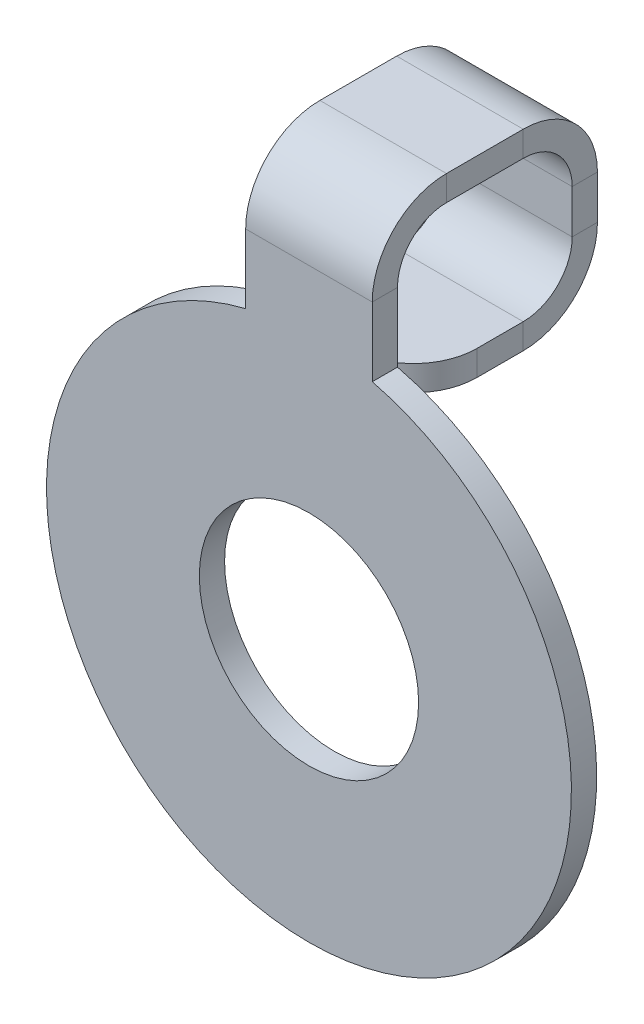
ISO-10303-21;
HEADER;
FILE_DESCRIPTION(('STEP AP214'),'2;1');
FILE_NAME('part.step','',(''),(''),'','','');
FILE_SCHEMA(('AUTOMOTIVE_DESIGN { 1 0 10303 214 1 1 1 1 }'));
ENDSEC;
DATA;
#1=APPLICATION_CONTEXT('core data for automotive mechanical design processes');
#2=APPLICATION_PROTOCOL_DEFINITION('international standard','automotive_design',2000,#1);
#3=PRODUCT_CONTEXT('',#1,'mechanical');
#4=PRODUCT('Part','Part','',(#3));
#5=PRODUCT_RELATED_PRODUCT_CATEGORY('part','',(#4));
#6=PRODUCT_DEFINITION_FORMATION('','',#4);
#7=PRODUCT_DEFINITION_CONTEXT('part definition',#1,'design');
#8=PRODUCT_DEFINITION('design','',#6,#7);
#9=PRODUCT_DEFINITION_SHAPE('','',#8);
#10=(LENGTH_UNIT() NAMED_UNIT(*) SI_UNIT(.MILLI.,.METRE.));
#11=(NAMED_UNIT(*) PLANE_ANGLE_UNIT() SI_UNIT($,.RADIAN.));
#12=(NAMED_UNIT(*) SI_UNIT($,.STERADIAN.) SOLID_ANGLE_UNIT());
#13=UNCERTAINTY_MEASURE_WITH_UNIT(LENGTH_MEASURE(1.E-05),#10,'distance_accuracy_value','');
#14=(GEOMETRIC_REPRESENTATION_CONTEXT(3) GLOBAL_UNCERTAINTY_ASSIGNED_CONTEXT((#13)) GLOBAL_UNIT_ASSIGNED_CONTEXT((#10,
#11,#12)) REPRESENTATION_CONTEXT('',''));
#15=CARTESIAN_POINT('',(0.,0.,0.));
#16=DIRECTION('',(0.,0.,1.));
#17=DIRECTION('',(1.,0.,0.));
#18=AXIS2_PLACEMENT_3D('',#15,#16,#17);
#19=CARTESIAN_POINT('',(0.,10.3311499382041,9.93344981461229));
#20=DIRECTION('',(0.,0.,-1.));
#21=DIRECTION('',(0.,1.,0.));
#22=AXIS2_PLACEMENT_3D('',#19,#20,#21);
#23=PLANE('',#22);
#24=DIRECTION('',(0.,1.,0.));
#25=VECTOR('',#24,1.);
#26=CARTESIAN_POINT('',(0.9525,6.49771234904212,9.93344981461227));
#27=LINE('',#26,#25);
#28=CARTESIAN_POINT('',(0.952500000000001,0.736600000000002,9.93344981461225));
#29=VERTEX_POINT('',#28);
#30=CARTESIAN_POINT('',(0.952500000000001,1.39225006179593,9.93344981461225));
#31=VERTEX_POINT('',#30);
#32=EDGE_CURVE('E56',#29,#31,#27,.T.);
#33=ORIENTED_EDGE('',*,*,#32,.F.);
#34=DIRECTION('',(-1.,0.,0.));
#35=VECTOR('',#34,1.);
#36=CARTESIAN_POINT('',(0.,0.736600000000004,9.93344981461225));
#37=LINE('',#36,#35);
#38=CARTESIAN_POINT('',(-0.952499999999999,0.736600000000004,9.93344981461225));
#39=VERTEX_POINT('',#38);
#40=EDGE_CURVE('E168',#29,#39,#37,.T.);
#41=ORIENTED_EDGE('',*,*,#40,.T.);
#42=DIRECTION('',(0.,-1.,0.));
#43=VECTOR('',#42,1.);
#44=CARTESIAN_POINT('',(-0.9525,6.49771234904212,9.93344981461227));
#45=LINE('',#44,#43);
#46=CARTESIAN_POINT('',(-0.952499999999999,1.39225006179593,9.93344981461225));
#47=VERTEX_POINT('',#46);
#48=EDGE_CURVE('E202',#47,#39,#45,.T.);
#49=ORIENTED_EDGE('',*,*,#48,.F.);
#50=DIRECTION('',(-1.,0.,0.));
#51=VECTOR('',#50,1.);
#52=CARTESIAN_POINT('',(0.,1.39225006179593,9.93344981461225));
#53=LINE('',#52,#51);
#54=EDGE_CURVE('E189',#31,#47,#53,.T.);
#55=ORIENTED_EDGE('',*,*,#54,.F.);
#56=EDGE_LOOP('',(#33,#41,#49,#55));
#57=FACE_BOUND('',#56,.T.);
#58=ADVANCED_FACE('F52',(#57),#23,.T.);
#59=CARTESIAN_POINT('',(0.9525,6.49771234904212,9.93344981461227));
#60=DIRECTION('',(1.,0.,0.));
#61=DIRECTION('',(0.,1.,0.));
#62=AXIS2_PLACEMENT_3D('',#59,#60,#61);
#63=PLANE('',#62);
#64=DIRECTION('',(0.,1.,0.));
#65=VECTOR('',#64,1.);
#66=CARTESIAN_POINT('',(0.9525,6.49771234904212,10.3134498146123));
#67=LINE('',#66,#65);
#68=CARTESIAN_POINT('',(0.952500000000001,0.736600000000002,10.3134498146123));
#69=VERTEX_POINT('',#68);
#70=CARTESIAN_POINT('',(0.952500000000001,1.39225006179593,10.3134498146123));
#71=VERTEX_POINT('',#70);
#72=EDGE_CURVE('E193',#69,#71,#67,.T.);
#73=ORIENTED_EDGE('',*,*,#72,.F.);
#74=DIRECTION('',(0.,0.,-1.));
#75=VECTOR('',#74,1.);
#76=CARTESIAN_POINT('',(0.952500000000001,0.736600000000004,9.93344981461225));
#77=LINE('',#76,#75);
#78=EDGE_CURVE('E175',#69,#29,#77,.T.);
#79=ORIENTED_EDGE('',*,*,#78,.T.);
#80=ORIENTED_EDGE('',*,*,#32,.T.);
#81=DIRECTION('',(0.,0.,-1.));
#82=VECTOR('',#81,1.);
#83=CARTESIAN_POINT('',(0.952500000000001,1.39225006179593,9.93344981461225));
#84=LINE('',#83,#82);
#85=EDGE_CURVE('E194',#71,#31,#84,.T.);
#86=ORIENTED_EDGE('',*,*,#85,.F.);
#87=EDGE_LOOP('',(#73,#79,#80,#86));
#88=FACE_BOUND('',#87,.T.);
#89=ADVANCED_FACE('F196',(#88),#63,.T.);
#90=CARTESIAN_POINT('',(-0.9525,6.49771234904212,9.93344981461227));
#91=DIRECTION('',(-1.,0.,0.));
#92=DIRECTION('',(0.,-1.,0.));
#93=AXIS2_PLACEMENT_3D('',#90,#91,#92);
#94=PLANE('',#93);
#95=ORIENTED_EDGE('',*,*,#48,.T.);
#96=DIRECTION('',(0.,0.,1.));
#97=VECTOR('',#96,1.);
#98=CARTESIAN_POINT('',(-0.952499999999999,0.736600000000004,9.93344981461225));
#99=LINE('',#98,#97);
#100=CARTESIAN_POINT('',(-0.952499999999999,0.736600000000002,10.3134498146123));
#101=VERTEX_POINT('',#100);
#102=EDGE_CURVE('E12',#39,#101,#99,.T.);
#103=ORIENTED_EDGE('',*,*,#102,.T.);
#104=DIRECTION('',(0.,-1.,0.));
#105=VECTOR('',#104,1.);
#106=CARTESIAN_POINT('',(-0.9525,6.49771234904212,10.3134498146123));
#107=LINE('',#106,#105);
#108=CARTESIAN_POINT('',(-0.952499999999999,1.39225006179593,10.3134498146123));
#109=VERTEX_POINT('',#108);
#110=EDGE_CURVE('E205',#109,#101,#107,.T.);
#111=ORIENTED_EDGE('',*,*,#110,.F.);
#112=DIRECTION('',(0.,0.,1.));
#113=VECTOR('',#112,1.);
#114=CARTESIAN_POINT('',(-0.952499999999999,1.39225006179593,9.93344981461225));
#115=LINE('',#114,#113);
#116=EDGE_CURVE('E218',#47,#109,#115,.T.);
#117=ORIENTED_EDGE('',*,*,#116,.F.);
#118=EDGE_LOOP('',(#95,#103,#111,#117));
#119=FACE_BOUND('',#118,.T.);
#120=ADVANCED_FACE('F54',(#119),#94,.T.);
#121=CARTESIAN_POINT('',(0.,2.50885006179587,18.5334498146123));
#122=DIRECTION('',(0.,1.,0.));
#123=DIRECTION('',(0.,0.,1.));
#124=AXIS2_PLACEMENT_3D('',#121,#122,#123);
#125=PLANE('',#124);
#126=DIRECTION('',(0.,0.,1.));
#127=VECTOR('',#126,1.);
#128=CARTESIAN_POINT('',(0.9525,2.5088500617959,14.7000122254503));
#129=LINE('',#128,#127);
#130=CARTESIAN_POINT('',(0.952500000000001,2.50885006179593,11.0500498146123));
#131=VERTEX_POINT('',#130);
#132=CARTESIAN_POINT('',(0.952499999999999,2.50885006179592,12.2056998764082));
#133=VERTEX_POINT('',#132);
#134=EDGE_CURVE('E242',#131,#133,#129,.T.);
#135=ORIENTED_EDGE('',*,*,#134,.F.);
#136=DIRECTION('',(-1.,0.,0.));
#137=VECTOR('',#136,1.);
#138=CARTESIAN_POINT('',(0.,2.50885006179593,11.0500498146123));
#139=LINE('',#138,#137);
#140=CARTESIAN_POINT('',(-0.9525,2.50885006179593,11.0500498146123));
#141=VERTEX_POINT('',#140);
#142=EDGE_CURVE('E281',#131,#141,#139,.T.);
#143=ORIENTED_EDGE('',*,*,#142,.T.);
#144=DIRECTION('',(0.,0.,-1.));
#145=VECTOR('',#144,1.);
#146=CARTESIAN_POINT('',(-0.9525,2.5088500617959,14.7000122254503));
#147=LINE('',#146,#145);
#148=CARTESIAN_POINT('',(-0.9525,2.50885006179592,12.2056998764082));
#149=VERTEX_POINT('',#148);
#150=EDGE_CURVE('E236',#149,#141,#147,.T.);
#151=ORIENTED_EDGE('',*,*,#150,.F.);
#152=DIRECTION('',(1.,0.,0.));
#153=VECTOR('',#152,1.);
#154=CARTESIAN_POINT('',(0.,2.50885006179592,12.2056998764082));
#155=LINE('',#154,#153);
#156=EDGE_CURVE('E243',#149,#133,#155,.T.);
#157=ORIENTED_EDGE('',*,*,#156,.T.);
#158=EDGE_LOOP('',(#135,#143,#151,#157));
#159=FACE_BOUND('',#158,.T.);
#160=ADVANCED_FACE('F314',(#159),#125,.T.);
#161=CARTESIAN_POINT('',(0.9525,2.5088500617959,14.7000122254503));
#162=DIRECTION('',(1.,0.,0.));
#163=DIRECTION('',(0.,0.,1.));
#164=AXIS2_PLACEMENT_3D('',#161,#162,#163);
#165=PLANE('',#164);
#166=DIRECTION('',(0.,0.,1.));
#167=VECTOR('',#166,1.);
#168=CARTESIAN_POINT('',(0.9525,2.1288500617959,14.7000122254503));
#169=LINE('',#168,#167);
#170=CARTESIAN_POINT('',(0.952500000000001,2.12885006179593,11.0500498146123));
#171=VERTEX_POINT('',#170);
#172=CARTESIAN_POINT('',(0.9525,2.12885006179592,12.2056998764082));
#173=VERTEX_POINT('',#172);
#174=EDGE_CURVE('E237',#171,#173,#169,.T.);
#175=ORIENTED_EDGE('',*,*,#174,.F.);
#176=DIRECTION('',(0.,1.,0.));
#177=VECTOR('',#176,1.);
#178=CARTESIAN_POINT('',(0.952500000000001,2.50885006179593,11.0500498146123));
#179=LINE('',#178,#177);
#180=EDGE_CURVE('E289',#171,#131,#179,.T.);
#181=ORIENTED_EDGE('',*,*,#180,.T.);
#182=ORIENTED_EDGE('',*,*,#134,.T.);
#183=DIRECTION('',(0.,-1.,0.));
#184=VECTOR('',#183,1.);
#185=CARTESIAN_POINT('',(0.9525,2.50885006179592,12.2056998764082));
#186=LINE('',#185,#184);
#187=EDGE_CURVE('E238',#133,#173,#186,.T.);
#188=ORIENTED_EDGE('',*,*,#187,.T.);
#189=EDGE_LOOP('',(#175,#181,#182,#188));
#190=FACE_BOUND('',#189,.T.);
#191=ADVANCED_FACE('F304',(#190),#165,.T.);
#192=CARTESIAN_POINT('',(-0.9525,2.5088500617959,14.7000122254503));
#193=DIRECTION('',(-1.,0.,0.));
#194=DIRECTION('',(0.,0.,-1.));
#195=AXIS2_PLACEMENT_3D('',#192,#193,#194);
#196=PLANE('',#195);
#197=ORIENTED_EDGE('',*,*,#150,.T.);
#198=DIRECTION('',(0.,-1.,0.));
#199=VECTOR('',#198,1.);
#200=CARTESIAN_POINT('',(-0.9525,2.50885006179593,11.0500498146123));
#201=LINE('',#200,#199);
#202=CARTESIAN_POINT('',(-0.952499999999999,2.12885006179593,11.0500498146123));
#203=VERTEX_POINT('',#202);
#204=EDGE_CURVE('E176',#141,#203,#201,.T.);
#205=ORIENTED_EDGE('',*,*,#204,.T.);
#206=DIRECTION('',(0.,0.,-1.));
#207=VECTOR('',#206,1.);
#208=CARTESIAN_POINT('',(-0.9525,2.1288500617959,14.7000122254503));
#209=LINE('',#208,#207);
#210=CARTESIAN_POINT('',(-0.9525,2.12885006179592,12.2056998764082));
#211=VERTEX_POINT('',#210);
#212=EDGE_CURVE('E241',#211,#203,#209,.T.);
#213=ORIENTED_EDGE('',*,*,#212,.F.);
#214=DIRECTION('',(0.,1.,0.));
#215=VECTOR('',#214,1.);
#216=CARTESIAN_POINT('',(-0.9525,2.50885006179592,12.2056998764082));
#217=LINE('',#216,#215);
#218=EDGE_CURVE('E233',#211,#149,#217,.T.);
#219=ORIENTED_EDGE('',*,*,#218,.T.);
#220=EDGE_LOOP('',(#197,#205,#213,#219));
#221=FACE_BOUND('',#220,.T.);
#222=ADVANCED_FACE('F317',(#221),#196,.T.);
#223=CARTESIAN_POINT('',(0.,-3.48000000000001,12.9422998764081));
#224=DIRECTION('',(0.,0.,1.));
#225=DIRECTION('',(0.,-1.,0.));
#226=AXIS2_PLACEMENT_3D('',#223,#224,#225);
#227=PLANE('',#226);
#228=CARTESIAN_POINT('',(0.,-3.48000000000001,12.9422998764081));
#229=DIRECTION('',(0.,0.,-1.));
#230=DIRECTION('',(0.,1.,0.));
#231=AXIS2_PLACEMENT_3D('',#228,#229,#230);
#232=CIRCLE('',#231,1.65);
#233=CARTESIAN_POINT('',(0.,-1.83000000000001,12.9422998764082));
#234=VERTEX_POINT('',#233);
#235=EDGE_CURVE('E252',#234,#234,#232,.T.);
#236=ORIENTED_EDGE('',*,*,#235,.F.);
#237=EDGE_LOOP('',(#236));
#238=FACE_BOUND('',#237,.T.);
#239=DIRECTION('',(0.,1.,0.));
#240=VECTOR('',#239,1.);
#241=CARTESIAN_POINT('',(-0.9525,0.353437589161967,12.9422998764082));
#242=LINE('',#241,#240);
#243=CARTESIAN_POINT('',(-0.9525,0.353437589161967,12.9422998764082));
#244=VERTEX_POINT('',#243);
#245=CARTESIAN_POINT('',(-0.9525,1.39225006179591,12.9422998764082));
#246=VERTEX_POINT('',#245);
#247=EDGE_CURVE('E262',#244,#246,#242,.T.);
#248=ORIENTED_EDGE('',*,*,#247,.T.);
#249=DIRECTION('',(1.,0.,0.));
#250=VECTOR('',#249,1.);
#251=CARTESIAN_POINT('',(0.,1.39225006179591,12.9422998764082));
#252=LINE('',#251,#250);
#253=CARTESIAN_POINT('',(0.9525,1.39225006179591,12.9422998764082));
#254=VERTEX_POINT('',#253);
#255=EDGE_CURVE('E275',#246,#254,#252,.T.);
#256=ORIENTED_EDGE('',*,*,#255,.T.);
#257=DIRECTION('',(0.,-1.,0.));
#258=VECTOR('',#257,1.);
#259=CARTESIAN_POINT('',(0.9525,0.353437589161967,12.9422998764082));
#260=LINE('',#259,#258);
#261=CARTESIAN_POINT('',(0.9525,0.353437589161967,12.9422998764082));
#262=VERTEX_POINT('',#261);
#263=EDGE_CURVE('E259',#254,#262,#260,.T.);
#264=ORIENTED_EDGE('',*,*,#263,.T.);
#265=CARTESIAN_POINT('',(0.,-3.48000000000001,12.9422998764081));
#266=DIRECTION('',(0.,0.,-1.));
#267=DIRECTION('',(0.,-1.,0.));
#268=AXIS2_PLACEMENT_3D('',#265,#266,#267);
#269=CIRCLE('',#268,3.95);
#270=EDGE_CURVE('E251',#262,#244,#269,.T.);
#271=ORIENTED_EDGE('',*,*,#270,.T.);
#272=EDGE_LOOP('',(#248,#256,#264,#271));
#273=FACE_BOUND('',#272,.T.);
#274=ADVANCED_FACE('F326',(#238,#273),#227,.F.);
#275=CARTESIAN_POINT('',(0.,-3.48000000000002,13.3222998764081));
#276=DIRECTION('',(0.,0.,-1.));
#277=DIRECTION('',(0.,1.,0.));
#278=AXIS2_PLACEMENT_3D('',#275,#276,#277);
#279=CYLINDRICAL_SURFACE('',#278,3.95);
#280=ORIENTED_EDGE('',*,*,#270,.F.);
#281=DIRECTION('',(0.,0.,-1.));
#282=VECTOR('',#281,1.);
#283=CARTESIAN_POINT('',(0.9525,0.353437589161964,13.3222998764082));
#284=LINE('',#283,#282);
#285=CARTESIAN_POINT('',(0.9525,0.353437589161964,13.3222998764082));
#286=VERTEX_POINT('',#285);
#287=EDGE_CURVE('E263',#286,#262,#284,.T.);
#288=ORIENTED_EDGE('',*,*,#287,.F.);
#289=CARTESIAN_POINT('',(0.,-3.48000000000002,13.3222998764081));
#290=DIRECTION('',(0.,0.,-1.));
#291=DIRECTION('',(0.,-1.,0.));
#292=AXIS2_PLACEMENT_3D('',#289,#290,#291);
#293=CIRCLE('',#292,3.95);
#294=CARTESIAN_POINT('',(-0.9525,0.353437589161964,13.3222998764082));
#295=VERTEX_POINT('',#294);
#296=EDGE_CURVE('E255',#286,#295,#293,.T.);
#297=ORIENTED_EDGE('',*,*,#296,.T.);
#298=DIRECTION('',(0.,0.,-1.));
#299=VECTOR('',#298,1.);
#300=CARTESIAN_POINT('',(-0.9525,0.353437589161964,13.3222998764082));
#301=LINE('',#300,#299);
#302=EDGE_CURVE('E267',#295,#244,#301,.T.);
#303=ORIENTED_EDGE('',*,*,#302,.T.);
#304=EDGE_LOOP('',(#280,#288,#297,#303));
#305=FACE_BOUND('',#304,.T.);
#306=ADVANCED_FACE('F340',(#305),#279,.T.);
#307=CARTESIAN_POINT('',(0.9525,0.353437589161964,13.3222998764082));
#308=DIRECTION('',(1.,0.,0.));
#309=DIRECTION('',(0.,-1.,0.));
#310=AXIS2_PLACEMENT_3D('',#307,#308,#309);
#311=PLANE('',#310);
#312=DIRECTION('',(0.,0.,-1.));
#313=VECTOR('',#312,1.);
#314=CARTESIAN_POINT('',(0.9525,1.39225006179591,13.3222998764082));
#315=LINE('',#314,#313);
#316=CARTESIAN_POINT('',(0.9525,1.39225006179591,13.3222998764082));
#317=VERTEX_POINT('',#316);
#318=EDGE_CURVE('E272',#317,#254,#315,.T.);
#319=ORIENTED_EDGE('',*,*,#318,.F.);
#320=DIRECTION('',(0.,-1.,0.));
#321=VECTOR('',#320,1.);
#322=CARTESIAN_POINT('',(0.9525,0.353437589161964,13.3222998764082));
#323=LINE('',#322,#321);
#324=EDGE_CURVE('E269',#317,#286,#323,.T.);
#325=ORIENTED_EDGE('',*,*,#324,.T.);
#326=ORIENTED_EDGE('',*,*,#287,.T.);
#327=ORIENTED_EDGE('',*,*,#263,.F.);
#328=EDGE_LOOP('',(#319,#325,#326,#327));
#329=FACE_BOUND('',#328,.T.);
#330=ADVANCED_FACE('F331',(#329),#311,.T.);
#331=CARTESIAN_POINT('',(-0.9525,0.353437589161964,13.3222998764082));
#332=DIRECTION('',(-1.,0.,0.));
#333=DIRECTION('',(0.,1.,0.));
#334=AXIS2_PLACEMENT_3D('',#331,#332,#333);
#335=PLANE('',#334);
#336=DIRECTION('',(0.,0.,1.));
#337=VECTOR('',#336,1.);
#338=CARTESIAN_POINT('',(-0.9525,1.39225006179591,13.3222998764082));
#339=LINE('',#338,#337);
#340=CARTESIAN_POINT('',(-0.9525,1.39225006179591,13.3222998764082));
#341=VERTEX_POINT('',#340);
#342=EDGE_CURVE('E278',#246,#341,#339,.T.);
#343=ORIENTED_EDGE('',*,*,#342,.F.);
#344=ORIENTED_EDGE('',*,*,#247,.F.);
#345=ORIENTED_EDGE('',*,*,#302,.F.);
#346=DIRECTION('',(0.,1.,0.));
#347=VECTOR('',#346,1.);
#348=CARTESIAN_POINT('',(-0.9525,0.353437589161964,13.3222998764082));
#349=LINE('',#348,#347);
#350=EDGE_CURVE('E258',#295,#341,#349,.T.);
#351=ORIENTED_EDGE('',*,*,#350,.T.);
#352=EDGE_LOOP('',(#343,#344,#345,#351));
#353=FACE_BOUND('',#352,.T.);
#354=ADVANCED_FACE('F342',(#353),#335,.T.);
#355=CARTESIAN_POINT('',(0.,-3.48000000000002,13.3222998764081));
#356=DIRECTION('',(0.,0.,1.));
#357=DIRECTION('',(0.,-1.,0.));
#358=AXIS2_PLACEMENT_3D('',#355,#356,#357);
#359=PLANE('',#358);
#360=DIRECTION('',(1.,0.,0.));
#361=VECTOR('',#360,1.);
#362=CARTESIAN_POINT('',(0.,1.39225006179591,13.3222998764082));
#363=LINE('',#362,#361);
#364=EDGE_CURVE('E266',#341,#317,#363,.T.);
#365=ORIENTED_EDGE('',*,*,#364,.F.);
#366=ORIENTED_EDGE('',*,*,#350,.F.);
#367=ORIENTED_EDGE('',*,*,#296,.F.);
#368=ORIENTED_EDGE('',*,*,#324,.F.);
#369=EDGE_LOOP('',(#365,#366,#367,#368));
#370=FACE_BOUND('',#369,.T.);
#371=CARTESIAN_POINT('',(0.,-3.48000000000002,13.3222998764081));
#372=DIRECTION('',(0.,0.,-1.));
#373=DIRECTION('',(0.,1.,0.));
#374=AXIS2_PLACEMENT_3D('',#371,#372,#373);
#375=CIRCLE('',#374,1.65);
#376=CARTESIAN_POINT('',(0.,-1.83000000000002,13.3222998764082));
#377=VERTEX_POINT('',#376);
#378=EDGE_CURVE('E248',#377,#377,#375,.T.);
#379=ORIENTED_EDGE('',*,*,#378,.T.);
#380=EDGE_LOOP('',(#379));
#381=FACE_BOUND('',#380,.T.);
#382=ADVANCED_FACE('F335',(#370,#381),#359,.T.);
#383=CARTESIAN_POINT('',(0.,-3.48000000000002,13.3222998764081));
#384=DIRECTION('',(0.,0.,-1.));
#385=DIRECTION('',(0.,1.,0.));
#386=AXIS2_PLACEMENT_3D('',#383,#384,#385);
#387=CYLINDRICAL_SURFACE('',#386,1.65);
#388=ORIENTED_EDGE('',*,*,#378,.F.);
#389=EDGE_LOOP('',(#388));
#390=FACE_BOUND('',#389,.T.);
#391=ORIENTED_EDGE('',*,*,#235,.T.);
#392=EDGE_LOOP('',(#391));
#393=FACE_BOUND('',#392,.T.);
#394=ADVANCED_FACE('F349',(#390,#393),#387,.F.);
#395=CARTESIAN_POINT('',(0.,2.12885006179587,18.5334498146123));
#396=DIRECTION('',(0.,1.,0.));
#397=DIRECTION('',(0.,0.,1.));
#398=AXIS2_PLACEMENT_3D('',#395,#396,#397);
#399=PLANE('',#398);
#400=DIRECTION('',(-1.,0.,0.));
#401=VECTOR('',#400,1.);
#402=CARTESIAN_POINT('',(0.,2.12885006179593,11.0500498146123));
#403=LINE('',#402,#401);
#404=EDGE_CURVE('E292',#171,#203,#403,.T.);
#405=ORIENTED_EDGE('',*,*,#404,.F.);
#406=ORIENTED_EDGE('',*,*,#174,.T.);
#407=DIRECTION('',(1.,0.,0.));
#408=VECTOR('',#407,1.);
#409=CARTESIAN_POINT('',(0.,2.12885006179592,12.2056998764082));
#410=LINE('',#409,#408);
#411=EDGE_CURVE('E228',#211,#173,#410,.T.);
#412=ORIENTED_EDGE('',*,*,#411,.F.);
#413=ORIENTED_EDGE('',*,*,#212,.T.);
#414=EDGE_LOOP('',(#405,#406,#412,#413));
#415=FACE_BOUND('',#414,.T.);
#416=ADVANCED_FACE('F427',(#415),#399,.F.);
#417=CARTESIAN_POINT('',(-0.9525,1.39225006179592,12.2056998764082));
#418=DIRECTION('',(-1.,0.,0.));
#419=DIRECTION('',(0.,0.,-1.));
#420=AXIS2_PLACEMENT_3D('',#417,#418,#419);
#421=PLANE('',#420);
#422=ORIENTED_EDGE('',*,*,#218,.F.);
#423=CARTESIAN_POINT('',(-0.9525,1.39225006179592,12.2056998764082));
#424=DIRECTION('',(1.,0.,0.));
#425=DIRECTION('',(0.,0.,1.));
#426=AXIS2_PLACEMENT_3D('',#423,#424,#425);
#427=CIRCLE('',#426,0.7366);
#428=EDGE_CURVE('E204',#211,#246,#427,.T.);
#429=ORIENTED_EDGE('',*,*,#428,.T.);
#430=ORIENTED_EDGE('',*,*,#342,.T.);
#431=CARTESIAN_POINT('',(-0.9525,1.39225006179592,12.2056998764082));
#432=DIRECTION('',(1.,0.,0.));
#433=DIRECTION('',(0.,0.,-1.));
#434=AXIS2_PLACEMENT_3D('',#431,#432,#433);
#435=CIRCLE('',#434,1.1166);
#436=EDGE_CURVE('E221',#149,#341,#435,.T.);
#437=ORIENTED_EDGE('',*,*,#436,.F.);
#438=EDGE_LOOP('',(#422,#429,#430,#437));
#439=FACE_BOUND('',#438,.T.);
#440=ADVANCED_FACE('F321',(#439),#421,.T.);
#441=CARTESIAN_POINT('',(0.9525,1.39225006179592,12.2056998764082));
#442=DIRECTION('',(1.,0.,0.));
#443=DIRECTION('',(0.,0.,1.));
#444=AXIS2_PLACEMENT_3D('',#441,#442,#443);
#445=PLANE('',#444);
#446=CARTESIAN_POINT('',(0.9525,1.39225006179592,12.2056998764082));
#447=DIRECTION('',(1.,0.,0.));
#448=DIRECTION('',(0.,0.,1.));
#449=AXIS2_PLACEMENT_3D('',#446,#447,#448);
#450=CIRCLE('',#449,0.7366);
#451=EDGE_CURVE('E225',#254,#173,#450,.F.);
#452=ORIENTED_EDGE('',*,*,#451,.T.);
#453=ORIENTED_EDGE('',*,*,#187,.F.);
#454=CARTESIAN_POINT('',(0.9525,1.39225006179592,12.2056998764082));
#455=DIRECTION('',(-1.,0.,0.));
#456=DIRECTION('',(0.,0.,1.));
#457=AXIS2_PLACEMENT_3D('',#454,#455,#456);
#458=CIRCLE('',#457,1.1166);
#459=EDGE_CURVE('E224',#317,#133,#458,.T.);
#460=ORIENTED_EDGE('',*,*,#459,.F.);
#461=ORIENTED_EDGE('',*,*,#318,.T.);
#462=EDGE_LOOP('',(#452,#453,#460,#461));
#463=FACE_BOUND('',#462,.T.);
#464=ADVANCED_FACE('F308',(#463),#445,.T.);
#465=CARTESIAN_POINT('',(-2.42732463634845,1.39225006179592,12.2056998764082));
#466=DIRECTION('',(1.,0.,0.));
#467=DIRECTION('',(0.,0.,1.));
#468=AXIS2_PLACEMENT_3D('',#465,#466,#467);
#469=CYLINDRICAL_SURFACE('',#468,1.1166);
#470=ORIENTED_EDGE('',*,*,#364,.T.);
#471=ORIENTED_EDGE('',*,*,#459,.T.);
#472=ORIENTED_EDGE('',*,*,#156,.F.);
#473=ORIENTED_EDGE('',*,*,#436,.T.);
#474=EDGE_LOOP('',(#470,#471,#472,#473));
#475=FACE_BOUND('',#474,.T.);
#476=ADVANCED_FACE('F311',(#475),#469,.T.);
#477=CARTESIAN_POINT('',(-2.42732463634845,1.39225006179592,12.2056998764082));
#478=DIRECTION('',(1.,0.,0.));
#479=DIRECTION('',(0.,0.,1.));
#480=AXIS2_PLACEMENT_3D('',#477,#478,#479);
#481=CYLINDRICAL_SURFACE('',#480,0.7366);
#482=ORIENTED_EDGE('',*,*,#255,.F.);
#483=ORIENTED_EDGE('',*,*,#428,.F.);
#484=ORIENTED_EDGE('',*,*,#411,.T.);
#485=ORIENTED_EDGE('',*,*,#451,.F.);
#486=EDGE_LOOP('',(#482,#483,#484,#485));
#487=FACE_BOUND('',#486,.T.);
#488=ADVANCED_FACE('F324',(#487),#481,.F.);
#489=CARTESIAN_POINT('',(0.,10.3311499382041,10.3134498146123));
#490=DIRECTION('',(0.,0.,-1.));
#491=DIRECTION('',(0.,1.,0.));
#492=AXIS2_PLACEMENT_3D('',#489,#490,#491);
#493=PLANE('',#492);
#494=DIRECTION('',(-1.,0.,0.));
#495=VECTOR('',#494,1.);
#496=CARTESIAN_POINT('',(0.,0.736600000000002,10.3134498146123));
#497=LINE('',#496,#495);
#498=EDGE_CURVE('E61',#69,#101,#497,.T.);
#499=ORIENTED_EDGE('',*,*,#498,.F.);
#500=ORIENTED_EDGE('',*,*,#72,.T.);
#501=DIRECTION('',(-1.,0.,0.));
#502=VECTOR('',#501,1.);
#503=CARTESIAN_POINT('',(0.,1.39225006179593,10.3134498146123));
#504=LINE('',#503,#502);
#505=EDGE_CURVE('E207',#71,#109,#504,.T.);
#506=ORIENTED_EDGE('',*,*,#505,.T.);
#507=ORIENTED_EDGE('',*,*,#110,.T.);
#508=EDGE_LOOP('',(#499,#500,#506,#507));
#509=FACE_BOUND('',#508,.T.);
#510=ADVANCED_FACE('F362',(#509),#493,.F.);
#511=CARTESIAN_POINT('',(0.952500000000001,1.39225006179593,11.0500498146123));
#512=DIRECTION('',(1.,0.,0.));
#513=DIRECTION('',(0.,1.,0.));
#514=AXIS2_PLACEMENT_3D('',#511,#512,#513);
#515=PLANE('',#514);
#516=ORIENTED_EDGE('',*,*,#180,.F.);
#517=CARTESIAN_POINT('',(0.952500000000001,1.39225006179593,11.0500498146123));
#518=DIRECTION('',(1.,0.,0.));
#519=DIRECTION('',(0.,1.,0.));
#520=AXIS2_PLACEMENT_3D('',#517,#518,#519);
#521=CIRCLE('',#520,0.7366);
#522=EDGE_CURVE('E391',#171,#71,#521,.F.);
#523=ORIENTED_EDGE('',*,*,#522,.T.);
#524=ORIENTED_EDGE('',*,*,#85,.T.);
#525=CARTESIAN_POINT('',(0.952500000000001,1.39225006179593,11.0500498146123));
#526=DIRECTION('',(-1.,0.,0.));
#527=DIRECTION('',(0.,1.,0.));
#528=AXIS2_PLACEMENT_3D('',#525,#526,#527);
#529=CIRCLE('',#528,1.1166);
#530=EDGE_CURVE('E415',#131,#31,#529,.T.);
#531=ORIENTED_EDGE('',*,*,#530,.F.);
#532=EDGE_LOOP('',(#516,#523,#524,#531));
#533=FACE_BOUND('',#532,.T.);
#534=ADVANCED_FACE('F364',(#533),#515,.T.);
#535=CARTESIAN_POINT('',(-0.9525,1.39225006179593,11.0500498146123));
#536=DIRECTION('',(-1.,0.,0.));
#537=DIRECTION('',(0.,-1.,0.));
#538=AXIS2_PLACEMENT_3D('',#535,#536,#537);
#539=PLANE('',#538);
#540=CARTESIAN_POINT('',(-0.952499999999999,1.39225006179593,11.0500498146123));
#541=DIRECTION('',(1.,0.,0.));
#542=DIRECTION('',(0.,1.,0.));
#543=AXIS2_PLACEMENT_3D('',#540,#541,#542);
#544=CIRCLE('',#543,0.7366);
#545=EDGE_CURVE('E215',#109,#203,#544,.T.);
#546=ORIENTED_EDGE('',*,*,#545,.T.);
#547=ORIENTED_EDGE('',*,*,#204,.F.);
#548=CARTESIAN_POINT('',(-0.9525,1.39225006179593,11.0500498146123));
#549=DIRECTION('',(1.,0.,0.));
#550=DIRECTION('',(0.,-1.,0.));
#551=AXIS2_PLACEMENT_3D('',#548,#549,#550);
#552=CIRCLE('',#551,1.1166);
#553=EDGE_CURVE('E77',#47,#141,#552,.T.);
#554=ORIENTED_EDGE('',*,*,#553,.F.);
#555=ORIENTED_EDGE('',*,*,#116,.T.);
#556=EDGE_LOOP('',(#546,#547,#554,#555));
#557=FACE_BOUND('',#556,.T.);
#558=ADVANCED_FACE('F369',(#557),#539,.T.);
#559=CARTESIAN_POINT('',(-2.42732463634845,1.39225006179593,11.0500498146123));
#560=DIRECTION('',(1.,0.,0.));
#561=DIRECTION('',(0.,1.,0.));
#562=AXIS2_PLACEMENT_3D('',#559,#560,#561);
#563=CYLINDRICAL_SURFACE('',#562,1.1166);
#564=ORIENTED_EDGE('',*,*,#54,.T.);
#565=ORIENTED_EDGE('',*,*,#553,.T.);
#566=ORIENTED_EDGE('',*,*,#142,.F.);
#567=ORIENTED_EDGE('',*,*,#530,.T.);
#568=EDGE_LOOP('',(#564,#565,#566,#567));
#569=FACE_BOUND('',#568,.T.);
#570=ADVANCED_FACE('F431',(#569),#563,.T.);
#571=CARTESIAN_POINT('',(-2.42732463634845,1.39225006179593,11.0500498146123));
#572=DIRECTION('',(1.,0.,0.));
#573=DIRECTION('',(0.,1.,0.));
#574=AXIS2_PLACEMENT_3D('',#571,#572,#573);
#575=CYLINDRICAL_SURFACE('',#574,0.7366);
#576=ORIENTED_EDGE('',*,*,#505,.F.);
#577=ORIENTED_EDGE('',*,*,#522,.F.);
#578=ORIENTED_EDGE('',*,*,#404,.T.);
#579=ORIENTED_EDGE('',*,*,#545,.F.);
#580=EDGE_LOOP('',(#576,#577,#578,#579));
#581=FACE_BOUND('',#580,.T.);
#582=ADVANCED_FACE('F428',(#581),#575,.F.);
#583=CARTESIAN_POINT('',(0.,-0.38,11.7475));
#584=DIRECTION('',(0.,1.,0.));
#585=DIRECTION('',(0.,0.,1.));
#586=AXIS2_PLACEMENT_3D('',#583,#584,#585);
#587=CYLINDRICAL_SURFACE('',#586,0.9525);
#588=CARTESIAN_POINT('',(0.,0.,11.7475));
#589=DIRECTION('',(0.,1.,0.));
#590=DIRECTION('',(0.,0.,-1.));
#591=AXIS2_PLACEMENT_3D('',#588,#589,#590);
#592=CIRCLE('',#591,0.9525);
#593=CARTESIAN_POINT('',(-0.952499999999999,0.,11.7475));
#594=VERTEX_POINT('',#593);
#595=CARTESIAN_POINT('',(0.952500000000001,0.,11.7475));
#596=VERTEX_POINT('',#595);
#597=EDGE_CURVE('E394',#594,#596,#592,.T.);
#598=ORIENTED_EDGE('',*,*,#597,.F.);
#599=DIRECTION('',(0.,1.,0.));
#600=VECTOR('',#599,1.);
#601=CARTESIAN_POINT('',(-0.952499999999999,-0.38,11.7475));
#602=LINE('',#601,#600);
#603=CARTESIAN_POINT('',(-0.952499999999999,-0.38,11.7475));
#604=VERTEX_POINT('',#603);
#605=EDGE_CURVE('E388',#604,#594,#602,.T.);
#606=ORIENTED_EDGE('',*,*,#605,.F.);
#607=CARTESIAN_POINT('',(0.,-0.38,11.7475));
#608=DIRECTION('',(0.,1.,0.));
#609=DIRECTION('',(0.,0.,-1.));
#610=AXIS2_PLACEMENT_3D('',#607,#608,#609);
#611=CIRCLE('',#610,0.9525);
#612=CARTESIAN_POINT('',(0.952500000000001,-0.38,11.7475));
#613=VERTEX_POINT('',#612);
#614=EDGE_CURVE('E408',#604,#613,#611,.T.);
#615=ORIENTED_EDGE('',*,*,#614,.T.);
#616=DIRECTION('',(0.,1.,0.));
#617=VECTOR('',#616,1.);
#618=CARTESIAN_POINT('',(0.952500000000001,-0.38,11.7475));
#619=LINE('',#618,#617);
#620=EDGE_CURVE('E406',#613,#596,#619,.T.);
#621=ORIENTED_EDGE('',*,*,#620,.T.);
#622=EDGE_LOOP('',(#598,#606,#615,#621));
#623=FACE_BOUND('',#622,.T.);
#624=ADVANCED_FACE('F430',(#623),#587,.T.);
#625=CARTESIAN_POINT('',(0.,-0.38,0.));
#626=DIRECTION('',(0.,-1.,0.));
#627=DIRECTION('',(0.,0.,-1.));
#628=AXIS2_PLACEMENT_3D('',#625,#626,#627);
#629=PLANE('',#628);
#630=DIRECTION('',(-1.,0.,0.));
#631=VECTOR('',#630,1.);
#632=CARTESIAN_POINT('',(0.,-0.38,11.0500498146123));
#633=LINE('',#632,#631);
#634=CARTESIAN_POINT('',(0.952500000000001,-0.38,11.0500498146123));
#635=VERTEX_POINT('',#634);
#636=CARTESIAN_POINT('',(-0.952499999999999,-0.38,11.0500498146123));
#637=VERTEX_POINT('',#636);
#638=EDGE_CURVE('E413',#635,#637,#633,.T.);
#639=ORIENTED_EDGE('',*,*,#638,.F.);
#640=DIRECTION('',(0.,0.,-1.));
#641=VECTOR('',#640,1.);
#642=CARTESIAN_POINT('',(0.9525,-0.38,3.83343758916198));
#643=LINE('',#642,#641);
#644=EDGE_CURVE('E404',#613,#635,#643,.T.);
#645=ORIENTED_EDGE('',*,*,#644,.F.);
#646=ORIENTED_EDGE('',*,*,#614,.F.);
#647=DIRECTION('',(0.,0.,1.));
#648=VECTOR('',#647,1.);
#649=CARTESIAN_POINT('',(-0.9525,-0.38,3.83343758916198));
#650=LINE('',#649,#648);
#651=EDGE_CURVE('E392',#637,#604,#650,.T.);
#652=ORIENTED_EDGE('',*,*,#651,.F.);
#653=EDGE_LOOP('',(#639,#645,#646,#652));
#654=FACE_BOUND('',#653,.T.);
#655=ADVANCED_FACE('F437',(#654),#629,.T.);
#656=CARTESIAN_POINT('',(0.9525,-0.38,3.83343758916198));
#657=DIRECTION('',(1.,0.,0.));
#658=DIRECTION('',(0.,0.,-1.));
#659=AXIS2_PLACEMENT_3D('',#656,#657,#658);
#660=PLANE('',#659);
#661=DIRECTION('',(0.,-1.,0.));
#662=VECTOR('',#661,1.);
#663=CARTESIAN_POINT('',(0.952500000000001,-0.38,11.0500498146123));
#664=LINE('',#663,#662);
#665=CARTESIAN_POINT('',(0.952500000000001,0.,11.0500498146123));
#666=VERTEX_POINT('',#665);
#667=EDGE_CURVE('E185',#666,#635,#664,.T.);
#668=ORIENTED_EDGE('',*,*,#667,.F.);
#669=DIRECTION('',(0.,0.,-1.));
#670=VECTOR('',#669,1.);
#671=CARTESIAN_POINT('',(0.9525,0.,3.83343758916198));
#672=LINE('',#671,#670);
#673=EDGE_CURVE('E402',#596,#666,#672,.T.);
#674=ORIENTED_EDGE('',*,*,#673,.F.);
#675=ORIENTED_EDGE('',*,*,#620,.F.);
#676=ORIENTED_EDGE('',*,*,#644,.T.);
#677=EDGE_LOOP('',(#668,#674,#675,#676));
#678=FACE_BOUND('',#677,.T.);
#679=ADVANCED_FACE('F543',(#678),#660,.T.);
#680=CARTESIAN_POINT('',(0.,0.,0.));
#681=DIRECTION('',(0.,-1.,0.));
#682=DIRECTION('',(0.,0.,-1.));
#683=AXIS2_PLACEMENT_3D('',#680,#681,#682);
#684=PLANE('',#683);
#685=ORIENTED_EDGE('',*,*,#673,.T.);
#686=DIRECTION('',(-1.,0.,0.));
#687=VECTOR('',#686,1.);
#688=CARTESIAN_POINT('',(0.,0.,11.0500498146123));
#689=LINE('',#688,#687);
#690=CARTESIAN_POINT('',(-0.952499999999999,0.,11.0500498146123));
#691=VERTEX_POINT('',#690);
#692=EDGE_CURVE('E399',#666,#691,#689,.T.);
#693=ORIENTED_EDGE('',*,*,#692,.T.);
#694=DIRECTION('',(0.,0.,1.));
#695=VECTOR('',#694,1.);
#696=CARTESIAN_POINT('',(-0.9525,0.,3.83343758916198));
#697=LINE('',#696,#695);
#698=EDGE_CURVE('E397',#691,#594,#697,.T.);
#699=ORIENTED_EDGE('',*,*,#698,.T.);
#700=ORIENTED_EDGE('',*,*,#597,.T.);
#701=EDGE_LOOP('',(#685,#693,#699,#700));
#702=FACE_BOUND('',#701,.T.);
#703=ADVANCED_FACE('F554',(#702),#684,.F.);
#704=CARTESIAN_POINT('',(-0.9525,-0.38,3.83343758916198));
#705=DIRECTION('',(-1.,0.,0.));
#706=DIRECTION('',(0.,0.,1.));
#707=AXIS2_PLACEMENT_3D('',#704,#705,#706);
#708=PLANE('',#707);
#709=DIRECTION('',(0.,1.,0.));
#710=VECTOR('',#709,1.);
#711=CARTESIAN_POINT('',(-0.952499999999999,-0.38,11.0500498146123));
#712=LINE('',#711,#710);
#713=EDGE_CURVE('E383',#637,#691,#712,.T.);
#714=ORIENTED_EDGE('',*,*,#713,.F.);
#715=ORIENTED_EDGE('',*,*,#651,.T.);
#716=ORIENTED_EDGE('',*,*,#605,.T.);
#717=ORIENTED_EDGE('',*,*,#698,.F.);
#718=EDGE_LOOP('',(#714,#715,#716,#717));
#719=FACE_BOUND('',#718,.T.);
#720=ADVANCED_FACE('F565',(#719),#708,.T.);
#721=CARTESIAN_POINT('',(0.952500000000001,0.7366,11.0500498146123));
#722=DIRECTION('',(1.,0.,0.));
#723=DIRECTION('',(0.,0.,-1.));
#724=AXIS2_PLACEMENT_3D('',#721,#722,#723);
#725=PLANE('',#724);
#726=ORIENTED_EDGE('',*,*,#78,.F.);
#727=CARTESIAN_POINT('',(0.952500000000001,0.7366,11.0500498146123));
#728=DIRECTION('',(1.,0.,0.));
#729=DIRECTION('',(0.,0.,-1.));
#730=AXIS2_PLACEMENT_3D('',#727,#728,#729);
#731=CIRCLE('',#730,0.7366);
#732=EDGE_CURVE('E378',#69,#666,#731,.F.);
#733=ORIENTED_EDGE('',*,*,#732,.T.);
#734=ORIENTED_EDGE('',*,*,#667,.T.);
#735=CARTESIAN_POINT('',(0.952500000000001,0.7366,11.0500498146123));
#736=DIRECTION('',(-1.,0.,0.));
#737=DIRECTION('',(0.,0.,-1.));
#738=AXIS2_PLACEMENT_3D('',#735,#736,#737);
#739=CIRCLE('',#738,1.1166);
#740=EDGE_CURVE('E171',#29,#635,#739,.T.);
#741=ORIENTED_EDGE('',*,*,#740,.F.);
#742=EDGE_LOOP('',(#726,#733,#734,#741));
#743=FACE_BOUND('',#742,.T.);
#744=ADVANCED_FACE('F180',(#743),#725,.T.);
#745=CARTESIAN_POINT('',(-0.952499999999999,0.7366,11.0500498146123));
#746=DIRECTION('',(-1.,0.,0.));
#747=DIRECTION('',(0.,0.,1.));
#748=AXIS2_PLACEMENT_3D('',#745,#746,#747);
#749=PLANE('',#748);
#750=CARTESIAN_POINT('',(-0.952499999999999,0.7366,11.0500498146123));
#751=DIRECTION('',(1.,0.,0.));
#752=DIRECTION('',(0.,0.,-1.));
#753=AXIS2_PLACEMENT_3D('',#750,#751,#752);
#754=CIRCLE('',#753,0.7366);
#755=EDGE_CURVE('E186',#691,#101,#754,.T.);
#756=ORIENTED_EDGE('',*,*,#755,.T.);
#757=ORIENTED_EDGE('',*,*,#102,.F.);
#758=CARTESIAN_POINT('',(-0.952499999999999,0.7366,11.0500498146123));
#759=DIRECTION('',(1.,0.,0.));
#760=DIRECTION('',(0.,0.,1.));
#761=AXIS2_PLACEMENT_3D('',#758,#759,#760);
#762=CIRCLE('',#761,1.1166);
#763=EDGE_CURVE('E69',#637,#39,#762,.T.);
#764=ORIENTED_EDGE('',*,*,#763,.F.);
#765=ORIENTED_EDGE('',*,*,#713,.T.);
#766=EDGE_LOOP('',(#756,#757,#764,#765));
#767=FACE_BOUND('',#766,.T.);
#768=ADVANCED_FACE('F381',(#767),#749,.T.);
#769=CARTESIAN_POINT('',(-2.42732463634845,0.7366,11.0500498146123));
#770=DIRECTION('',(1.,0.,0.));
#771=DIRECTION('',(0.,0.,-1.));
#772=AXIS2_PLACEMENT_3D('',#769,#770,#771);
#773=CYLINDRICAL_SURFACE('',#772,1.1166);
#774=ORIENTED_EDGE('',*,*,#638,.T.);
#775=ORIENTED_EDGE('',*,*,#763,.T.);
#776=ORIENTED_EDGE('',*,*,#40,.F.);
#777=ORIENTED_EDGE('',*,*,#740,.T.);
#778=EDGE_LOOP('',(#774,#775,#776,#777));
#779=FACE_BOUND('',#778,.T.);
#780=ADVANCED_FACE('F170',(#779),#773,.T.);
#781=CARTESIAN_POINT('',(-2.42732463634845,0.7366,11.0500498146123));
#782=DIRECTION('',(1.,0.,0.));
#783=DIRECTION('',(0.,0.,-1.));
#784=AXIS2_PLACEMENT_3D('',#781,#782,#783);
#785=CYLINDRICAL_SURFACE('',#784,0.7366);
#786=ORIENTED_EDGE('',*,*,#692,.F.);
#787=ORIENTED_EDGE('',*,*,#732,.F.);
#788=ORIENTED_EDGE('',*,*,#498,.T.);
#789=ORIENTED_EDGE('',*,*,#755,.F.);
#790=EDGE_LOOP('',(#786,#787,#788,#789));
#791=FACE_BOUND('',#790,.T.);
#792=ADVANCED_FACE('F377',(#791),#785,.F.);
#793=CLOSED_SHELL('',(#58,#89,#120,#160,#191,#222,#274,#306,#330,#354,#382,#394,#416,#440,#464,
#476,#488,#510,#534,#558,#570,#582,#624,#655,#679,#703,#720,#744,#768,#780,#792));
#794=MANIFOLD_SOLID_BREP('B2',#793);
#795=ADVANCED_BREP_SHAPE_REPRESENTATION('',(#18,#794),#14);
#796=SHAPE_DEFINITION_REPRESENTATION(#9,#795);
ENDSEC;
END-ISO-10303-21;
